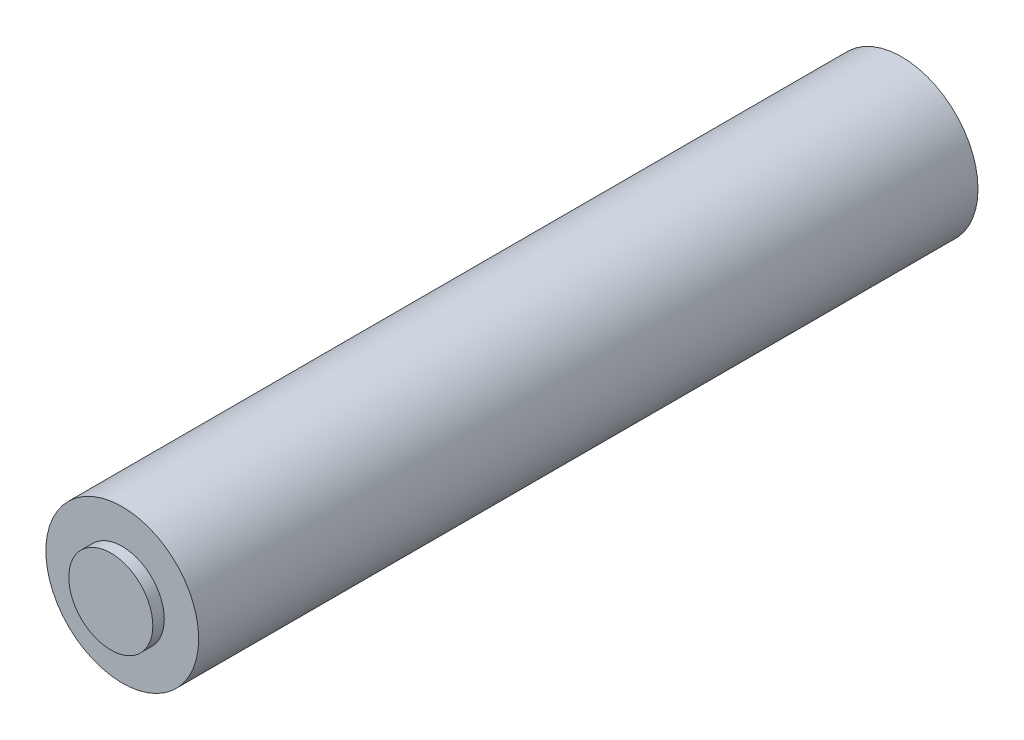
ISO-10303-21;
HEADER;
FILE_DESCRIPTION(('STEP AP214'),'2;1');
FILE_NAME('part.step','',(''),(''),'','','');
FILE_SCHEMA(('AUTOMOTIVE_DESIGN { 1 0 10303 214 1 1 1 1 }'));
ENDSEC;
DATA;
#1=APPLICATION_CONTEXT('core data for automotive mechanical design processes');
#2=APPLICATION_PROTOCOL_DEFINITION('international standard','automotive_design',2000,#1);
#3=PRODUCT_CONTEXT('',#1,'mechanical');
#4=PRODUCT('Part','Part','',(#3));
#5=PRODUCT_RELATED_PRODUCT_CATEGORY('part','',(#4));
#6=PRODUCT_DEFINITION_FORMATION('','',#4);
#7=PRODUCT_DEFINITION_CONTEXT('part definition',#1,'design');
#8=PRODUCT_DEFINITION('design','',#6,#7);
#9=PRODUCT_DEFINITION_SHAPE('','',#8);
#10=(LENGTH_UNIT() NAMED_UNIT(*) SI_UNIT(.MILLI.,.METRE.));
#11=(NAMED_UNIT(*) PLANE_ANGLE_UNIT() SI_UNIT($,.RADIAN.));
#12=(NAMED_UNIT(*) SI_UNIT($,.STERADIAN.) SOLID_ANGLE_UNIT());
#13=UNCERTAINTY_MEASURE_WITH_UNIT(LENGTH_MEASURE(1.E-05),#10,'distance_accuracy_value','');
#14=(GEOMETRIC_REPRESENTATION_CONTEXT(3) GLOBAL_UNCERTAINTY_ASSIGNED_CONTEXT((#13)) GLOBAL_UNIT_ASSIGNED_CONTEXT((#10,
#11,#12)) REPRESENTATION_CONTEXT('',''));
#15=CARTESIAN_POINT('',(0.,0.,0.));
#16=DIRECTION('',(0.,0.,1.));
#17=DIRECTION('',(1.,0.,0.));
#18=AXIS2_PLACEMENT_3D('',#15,#16,#17);
#19=CARTESIAN_POINT('',(0.,0.,102.));
#20=DIRECTION('',(0.,0.,-1.));
#21=DIRECTION('',(-1.,0.,0.));
#22=AXIS2_PLACEMENT_3D('',#19,#20,#21);
#23=CYLINDRICAL_SURFACE('',#22,10.);
#24=CARTESIAN_POINT('',(0.,0.,102.));
#25=DIRECTION('',(0.,0.,1.));
#26=DIRECTION('',(1.,0.,0.));
#27=AXIS2_PLACEMENT_3D('',#24,#25,#26);
#28=CIRCLE('',#27,10.);
#29=CARTESIAN_POINT('',(10.,0.,102.));
#30=VERTEX_POINT('',#29);
#31=EDGE_CURVE('E38',#30,#30,#28,.T.);
#32=ORIENTED_EDGE('',*,*,#31,.F.);
#33=EDGE_LOOP('',(#32));
#34=FACE_BOUND('',#33,.T.);
#35=CARTESIAN_POINT('',(0.,0.,0.));
#36=DIRECTION('',(0.,0.,1.));
#37=DIRECTION('',(1.,0.,0.));
#38=AXIS2_PLACEMENT_3D('',#35,#36,#37);
#39=CIRCLE('',#38,10.);
#40=CARTESIAN_POINT('',(10.,0.,0.));
#41=VERTEX_POINT('',#40);
#42=EDGE_CURVE('E43',#41,#41,#39,.T.);
#43=ORIENTED_EDGE('',*,*,#42,.T.);
#44=EDGE_LOOP('',(#43));
#45=FACE_BOUND('',#44,.T.);
#46=ADVANCED_FACE('F31',(#34,#45),#23,.T.);
#47=CARTESIAN_POINT('',(0.,0.,102.));
#48=DIRECTION('',(0.,0.,1.));
#49=DIRECTION('',(1.,0.,0.));
#50=AXIS2_PLACEMENT_3D('',#47,#48,#49);
#51=PLANE('',#50);
#52=CARTESIAN_POINT('',(0.,0.,102.));
#53=DIRECTION('',(0.,0.,1.));
#54=DIRECTION('',(1.,0.,0.));
#55=AXIS2_PLACEMENT_3D('',#52,#53,#54);
#56=CIRCLE('',#55,5.5);
#57=CARTESIAN_POINT('',(5.5,0.,102.));
#58=VERTEX_POINT('',#57);
#59=EDGE_CURVE('E10',#58,#58,#56,.T.);
#60=ORIENTED_EDGE('',*,*,#59,.F.);
#61=EDGE_LOOP('',(#60));
#62=FACE_BOUND('',#61,.T.);
#63=ORIENTED_EDGE('',*,*,#31,.T.);
#64=EDGE_LOOP('',(#63));
#65=FACE_BOUND('',#64,.T.);
#66=ADVANCED_FACE('F76',(#62,#65),#51,.T.);
#67=CARTESIAN_POINT('',(0.,0.,0.));
#68=DIRECTION('',(0.,0.,1.));
#69=DIRECTION('',(1.,0.,0.));
#70=AXIS2_PLACEMENT_3D('',#67,#68,#69);
#71=PLANE('',#70);
#72=CARTESIAN_POINT('',(0.,0.,0.));
#73=DIRECTION('',(0.,0.,1.));
#74=DIRECTION('',(1.,0.,0.));
#75=AXIS2_PLACEMENT_3D('',#72,#73,#74);
#76=CIRCLE('',#75,5.5);
#77=CARTESIAN_POINT('',(5.5,0.,0.));
#78=VERTEX_POINT('',#77);
#79=EDGE_CURVE('E34',#78,#78,#76,.T.);
#80=ORIENTED_EDGE('',*,*,#79,.T.);
#81=EDGE_LOOP('',(#80));
#82=FACE_BOUND('',#81,.T.);
#83=ORIENTED_EDGE('',*,*,#42,.F.);
#84=EDGE_LOOP('',(#83));
#85=FACE_BOUND('',#84,.T.);
#86=ADVANCED_FACE('F81',(#82,#85),#71,.F.);
#87=CARTESIAN_POINT('',(0.,0.,-1.5));
#88=DIRECTION('',(0.,0.,1.));
#89=DIRECTION('',(1.,0.,0.));
#90=AXIS2_PLACEMENT_3D('',#87,#88,#89);
#91=PLANE('',#90);
#92=CARTESIAN_POINT('',(0.,0.,-1.5));
#93=DIRECTION('',(0.,0.,1.));
#94=DIRECTION('',(1.,0.,0.));
#95=AXIS2_PLACEMENT_3D('',#92,#93,#94);
#96=CIRCLE('',#95,5.5);
#97=CARTESIAN_POINT('',(5.5,0.,-1.5));
#98=VERTEX_POINT('',#97);
#99=EDGE_CURVE('E46',#98,#98,#96,.T.);
#100=ORIENTED_EDGE('',*,*,#99,.F.);
#101=EDGE_LOOP('',(#100));
#102=FACE_BOUND('',#101,.T.);
#103=ADVANCED_FACE('F72',(#102),#91,.F.);
#104=CARTESIAN_POINT('',(0.,0.,-1.5));
#105=DIRECTION('',(0.,0.,1.));
#106=DIRECTION('',(1.,0.,0.));
#107=AXIS2_PLACEMENT_3D('',#104,#105,#106);
#108=CYLINDRICAL_SURFACE('',#107,5.5);
#109=ORIENTED_EDGE('',*,*,#99,.T.);
#110=EDGE_LOOP('',(#109));
#111=FACE_BOUND('',#110,.T.);
#112=ORIENTED_EDGE('',*,*,#79,.F.);
#113=EDGE_LOOP('',(#112));
#114=FACE_BOUND('',#113,.T.);
#115=ADVANCED_FACE('F65',(#111,#114),#108,.T.);
#116=ORIENTED_EDGE('',*,*,#59,.T.);
#117=EDGE_LOOP('',(#116));
#118=FACE_BOUND('',#117,.T.);
#119=CARTESIAN_POINT('',(0.,0.,103.5));
#120=DIRECTION('',(0.,0.,1.));
#121=DIRECTION('',(1.,0.,0.));
#122=AXIS2_PLACEMENT_3D('',#119,#120,#121);
#123=CIRCLE('',#122,5.5);
#124=CARTESIAN_POINT('',(5.5,0.,103.5));
#125=VERTEX_POINT('',#124);
#126=EDGE_CURVE('E55',#125,#125,#123,.T.);
#127=ORIENTED_EDGE('',*,*,#126,.F.);
#128=EDGE_LOOP('',(#127));
#129=FACE_BOUND('',#128,.T.);
#130=ADVANCED_FACE('F63',(#118,#129),#108,.T.);
#131=CARTESIAN_POINT('',(0.,0.,103.5));
#132=DIRECTION('',(0.,0.,1.));
#133=DIRECTION('',(1.,0.,0.));
#134=AXIS2_PLACEMENT_3D('',#131,#132,#133);
#135=PLANE('',#134);
#136=ORIENTED_EDGE('',*,*,#126,.T.);
#137=EDGE_LOOP('',(#136));
#138=FACE_BOUND('',#137,.T.);
#139=ADVANCED_FACE('F61',(#138),#135,.T.);
#140=CLOSED_SHELL('',(#46,#66,#86,#103,#115,#130,#139));
#141=MANIFOLD_SOLID_BREP('B2',#140);
#142=ADVANCED_BREP_SHAPE_REPRESENTATION('',(#18,#141),#14);
#143=SHAPE_DEFINITION_REPRESENTATION(#9,#142);
ENDSEC;
END-ISO-10303-21;
